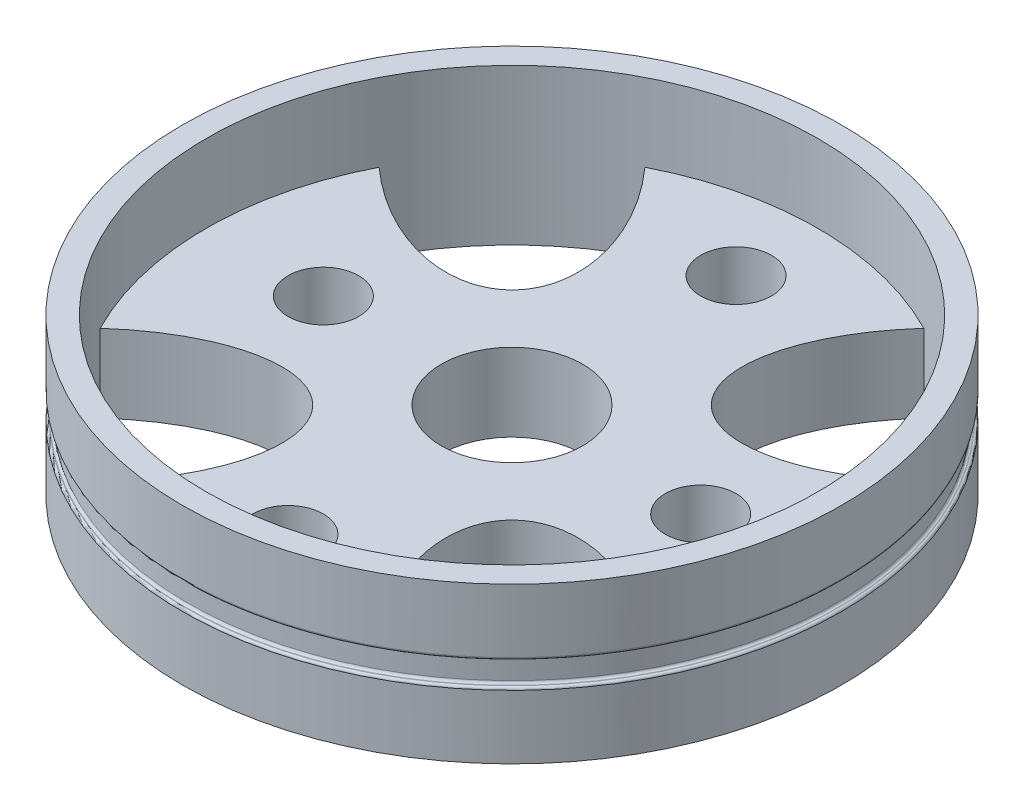
ISO-10303-21;
HEADER;
FILE_DESCRIPTION(('STEP AP214'),'2;1');
FILE_NAME('part.step','',(''),(''),'','','');
FILE_SCHEMA(('AUTOMOTIVE_DESIGN { 1 0 10303 214 1 1 1 1 }'));
ENDSEC;
DATA;
#1=APPLICATION_CONTEXT('core data for automotive mechanical design processes');
#2=APPLICATION_PROTOCOL_DEFINITION('international standard','automotive_design',2000,#1);
#3=PRODUCT_CONTEXT('',#1,'mechanical');
#4=PRODUCT('Part','Part','',(#3));
#5=PRODUCT_RELATED_PRODUCT_CATEGORY('part','',(#4));
#6=PRODUCT_DEFINITION_FORMATION('','',#4);
#7=PRODUCT_DEFINITION_CONTEXT('part definition',#1,'design');
#8=PRODUCT_DEFINITION('design','',#6,#7);
#9=PRODUCT_DEFINITION_SHAPE('','',#8);
#10=(LENGTH_UNIT() NAMED_UNIT(*) SI_UNIT(.MILLI.,.METRE.));
#11=(NAMED_UNIT(*) PLANE_ANGLE_UNIT() SI_UNIT($,.RADIAN.));
#12=(NAMED_UNIT(*) SI_UNIT($,.STERADIAN.) SOLID_ANGLE_UNIT());
#13=UNCERTAINTY_MEASURE_WITH_UNIT(LENGTH_MEASURE(1.E-05),#10,'distance_accuracy_value','');
#14=(GEOMETRIC_REPRESENTATION_CONTEXT(3) GLOBAL_UNCERTAINTY_ASSIGNED_CONTEXT((#13)) GLOBAL_UNIT_ASSIGNED_CONTEXT((#10,
#11,#12)) REPRESENTATION_CONTEXT('',''));
#15=CARTESIAN_POINT('',(0.,0.,0.));
#16=DIRECTION('',(0.,0.,1.));
#17=DIRECTION('',(1.,0.,0.));
#18=AXIS2_PLACEMENT_3D('',#15,#16,#17);
#19=CARTESIAN_POINT('',(0.,3.3,0.));
#20=DIRECTION('',(0.,1.,0.));
#21=DIRECTION('',(0.,0.,1.));
#22=AXIS2_PLACEMENT_3D('',#19,#20,#21);
#23=PLANE('',#22);
#24=CARTESIAN_POINT('',(-9.17471048589553,3.3,9.17471048589537));
#25=DIRECTION('',(0.,1.,0.));
#26=DIRECTION('',(-0.707106781186536,0.,0.707106781186559));
#27=AXIS2_PLACEMENT_3D('',#24,#25,#26);
#28=ELLIPSE('',#27,7.,4.00000000000012);
#29=CARTESIAN_POINT('',(-5.91445391265301,3.3,11.5485869228709));
#30=VERTEX_POINT('',#29);
#31=CARTESIAN_POINT('',(-11.5485869228712,3.3,5.91445391265352));
#32=VERTEX_POINT('',#31);
#33=EDGE_CURVE('E185',#30,#32,#28,.T.);
#34=ORIENTED_EDGE('',*,*,#33,.F.);
#35=CARTESIAN_POINT('',(0.,3.3,0.));
#36=DIRECTION('',(0.,1.,0.));
#37=DIRECTION('',(0.,0.,1.));
#38=AXIS2_PLACEMENT_3D('',#35,#36,#37);
#39=CIRCLE('',#38,12.975);
#40=CARTESIAN_POINT('',(5.91445391265348,3.3,11.5485869228714));
#41=VERTEX_POINT('',#40);
#42=EDGE_CURVE('E287',#30,#41,#39,.T.);
#43=ORIENTED_EDGE('',*,*,#42,.T.);
#44=CARTESIAN_POINT('',(9.1747104858954,3.3,9.1747104858955));
#45=DIRECTION('',(0.,1.,0.));
#46=DIRECTION('',(0.707106781186554,0.,0.707106781186541));
#47=AXIS2_PLACEMENT_3D('',#44,#45,#46);
#48=ELLIPSE('',#47,7.,4.00000000000006);
#49=CARTESIAN_POINT('',(11.5485869228708,3.3,5.914453912653));
#50=VERTEX_POINT('',#49);
#51=EDGE_CURVE('E149',#50,#41,#48,.T.);
#52=ORIENTED_EDGE('',*,*,#51,.F.);
#53=CARTESIAN_POINT('',(11.5485869228713,3.3,-5.91445391265322));
#54=VERTEX_POINT('',#53);
#55=EDGE_CURVE('E281',#50,#54,#39,.T.);
#56=ORIENTED_EDGE('',*,*,#55,.T.);
#57=CARTESIAN_POINT('',(9.17471048589545,3.3,-9.17471048589545));
#58=DIRECTION('',(0.,1.,0.));
#59=DIRECTION('',(0.707106781186548,0.,-0.707106781186548));
#60=AXIS2_PLACEMENT_3D('',#57,#58,#59);
#61=ELLIPSE('',#60,7.,4.);
#62=CARTESIAN_POINT('',(5.914453912653,3.3,-11.5485869228709));
#63=VERTEX_POINT('',#62);
#64=EDGE_CURVE('E110',#63,#54,#61,.T.);
#65=ORIENTED_EDGE('',*,*,#64,.F.);
#66=CARTESIAN_POINT('',(-5.91445391265325,3.3,-11.5485869228711));
#67=VERTEX_POINT('',#66);
#68=EDGE_CURVE('E481',#63,#67,#39,.T.);
#69=ORIENTED_EDGE('',*,*,#68,.T.);
#70=CARTESIAN_POINT('',(-9.17471048589534,3.3,-9.17471048589557));
#71=DIRECTION('',(0.,1.,0.));
#72=DIRECTION('',(-0.707106781186564,0.,-0.707106781186531));
#73=AXIS2_PLACEMENT_3D('',#70,#71,#72);
#74=ELLIPSE('',#73,7.,4.00000000000016);
#75=CARTESIAN_POINT('',(-11.5485869228708,3.3,-5.91445391265301));
#76=VERTEX_POINT('',#75);
#77=EDGE_CURVE('E124',#76,#67,#74,.T.);
#78=ORIENTED_EDGE('',*,*,#77,.F.);
#79=EDGE_CURVE('E118',#76,#32,#39,.T.);
#80=ORIENTED_EDGE('',*,*,#79,.T.);
#81=EDGE_LOOP('',(#34,#43,#52,#56,#65,#69,#78,#80));
#82=FACE_BOUND('',#81,.T.);
#83=CARTESIAN_POINT('',(0.,3.3,0.));
#84=DIRECTION('',(0.,1.,0.));
#85=DIRECTION('',(0.,0.,1.));
#86=AXIS2_PLACEMENT_3D('',#83,#84,#85);
#87=CIRCLE('',#86,3.);
#88=CARTESIAN_POINT('',(0.,3.3,3.));
#89=VERTEX_POINT('',#88);
#90=EDGE_CURVE('E162',#89,#89,#87,.T.);
#91=ORIENTED_EDGE('',*,*,#90,.F.);
#92=EDGE_LOOP('',(#91));
#93=FACE_BOUND('',#92,.T.);
#94=CARTESIAN_POINT('',(0.,3.3,9.5));
#95=DIRECTION('',(0.,-1.,0.));
#96=DIRECTION('',(0.,0.,-1.));
#97=AXIS2_PLACEMENT_3D('',#94,#95,#96);
#98=CIRCLE('',#97,1.5);
#99=CARTESIAN_POINT('',(0.,3.3,8.));
#100=VERTEX_POINT('',#99);
#101=EDGE_CURVE('E179',#100,#100,#98,.T.);
#102=ORIENTED_EDGE('',*,*,#101,.T.);
#103=EDGE_LOOP('',(#102));
#104=FACE_BOUND('',#103,.T.);
#105=CARTESIAN_POINT('',(0.,3.3,-9.5));
#106=DIRECTION('',(0.,1.,0.));
#107=DIRECTION('',(0.,0.,1.));
#108=AXIS2_PLACEMENT_3D('',#105,#106,#107);
#109=CIRCLE('',#108,1.5);
#110=CARTESIAN_POINT('',(0.,3.3,-8.));
#111=VERTEX_POINT('',#110);
#112=EDGE_CURVE('E175',#111,#111,#109,.T.);
#113=ORIENTED_EDGE('',*,*,#112,.F.);
#114=EDGE_LOOP('',(#113));
#115=FACE_BOUND('',#114,.T.);
#116=CARTESIAN_POINT('',(8.,3.3,0.));
#117=DIRECTION('',(0.,1.,0.));
#118=DIRECTION('',(0.,0.,1.));
#119=AXIS2_PLACEMENT_3D('',#116,#117,#118);
#120=CIRCLE('',#119,1.5);
#121=CARTESIAN_POINT('',(8.,3.3,1.5));
#122=VERTEX_POINT('',#121);
#123=EDGE_CURVE('E172',#122,#122,#120,.T.);
#124=ORIENTED_EDGE('',*,*,#123,.F.);
#125=EDGE_LOOP('',(#124));
#126=FACE_BOUND('',#125,.T.);
#127=CARTESIAN_POINT('',(-8.,3.3,0.));
#128=DIRECTION('',(0.,-1.,0.));
#129=DIRECTION('',(0.,0.,-1.));
#130=AXIS2_PLACEMENT_3D('',#127,#128,#129);
#131=CIRCLE('',#130,1.5);
#132=CARTESIAN_POINT('',(-8.,3.3,-1.5));
#133=VERTEX_POINT('',#132);
#134=EDGE_CURVE('E171',#133,#133,#131,.T.);
#135=ORIENTED_EDGE('',*,*,#134,.T.);
#136=EDGE_LOOP('',(#135));
#137=FACE_BOUND('',#136,.T.);
#138=ADVANCED_FACE('F38',(#82,#93,#104,#115,#126,#137),#23,.T.);
#139=CARTESIAN_POINT('',(0.,0.,0.));
#140=DIRECTION('',(0.,1.,0.));
#141=DIRECTION('',(0.,0.,1.));
#142=AXIS2_PLACEMENT_3D('',#139,#140,#141);
#143=PLANE('',#142);
#144=CARTESIAN_POINT('',(8.,0.,0.));
#145=DIRECTION('',(0.,1.,0.));
#146=DIRECTION('',(0.,0.,1.));
#147=AXIS2_PLACEMENT_3D('',#144,#145,#146);
#148=CIRCLE('',#147,1.5);
#149=CARTESIAN_POINT('',(8.,0.,1.5));
#150=VERTEX_POINT('',#149);
#151=EDGE_CURVE('E176',#150,#150,#148,.F.);
#152=ORIENTED_EDGE('',*,*,#151,.F.);
#153=EDGE_LOOP('',(#152));
#154=FACE_BOUND('',#153,.T.);
#155=CARTESIAN_POINT('',(0.,0.,0.));
#156=DIRECTION('',(0.,1.,0.));
#157=DIRECTION('',(0.,0.,1.));
#158=AXIS2_PLACEMENT_3D('',#155,#156,#157);
#159=CIRCLE('',#158,12.9750000000004);
#160=CARTESIAN_POINT('',(-5.914453912653,0.,-11.5485869228713));
#161=VERTEX_POINT('',#160);
#162=CARTESIAN_POINT('',(-11.5485869228711,0.,-5.91445391265322));
#163=VERTEX_POINT('',#162);
#164=EDGE_CURVE('E109',#161,#163,#159,.T.);
#165=ORIENTED_EDGE('',*,*,#164,.T.);
#166=CARTESIAN_POINT('',(-9.17471048589534,0.,-9.17471048589557));
#167=DIRECTION('',(0.,1.,0.));
#168=DIRECTION('',(-0.707106781186564,0.,-0.707106781186531));
#169=AXIS2_PLACEMENT_3D('',#166,#167,#168);
#170=ELLIPSE('',#169,7.,4.00000000000016);
#171=EDGE_CURVE('E103',#161,#163,#170,.F.);
#172=ORIENTED_EDGE('',*,*,#171,.F.);
#173=EDGE_LOOP('',(#165,#172));
#174=FACE_BOUND('',#173,.T.);
#175=CARTESIAN_POINT('',(0.,0.,0.));
#176=DIRECTION('',(0.,1.,0.));
#177=DIRECTION('',(0.,0.,1.));
#178=AXIS2_PLACEMENT_3D('',#175,#176,#177);
#179=CIRCLE('',#178,12.9750000000007);
#180=CARTESIAN_POINT('',(5.91445391265336,0.,11.5485869228715));
#181=VERTEX_POINT('',#180);
#182=CARTESIAN_POINT('',(11.5485869228714,0.,5.91445391265346));
#183=VERTEX_POINT('',#182);
#184=EDGE_CURVE('E150',#181,#183,#179,.T.);
#185=ORIENTED_EDGE('',*,*,#184,.T.);
#186=CARTESIAN_POINT('',(9.1747104858954,0.,9.1747104858955));
#187=DIRECTION('',(0.,1.,0.));
#188=DIRECTION('',(0.707106781186554,0.,0.707106781186541));
#189=AXIS2_PLACEMENT_3D('',#186,#187,#188);
#190=ELLIPSE('',#189,7.,4.00000000000006);
#191=EDGE_CURVE('E154',#181,#183,#190,.F.);
#192=ORIENTED_EDGE('',*,*,#191,.F.);
#193=EDGE_LOOP('',(#185,#192));
#194=FACE_BOUND('',#193,.T.);
#195=CARTESIAN_POINT('',(0.,0.,0.));
#196=DIRECTION('',(0.,1.,0.));
#197=DIRECTION('',(0.,0.,1.));
#198=AXIS2_PLACEMENT_3D('',#195,#196,#197);
#199=CIRCLE('',#198,3.);
#200=CARTESIAN_POINT('',(0.,0.,3.));
#201=VERTEX_POINT('',#200);
#202=EDGE_CURVE('E163',#201,#201,#199,.F.);
#203=ORIENTED_EDGE('',*,*,#202,.F.);
#204=EDGE_LOOP('',(#203));
#205=FACE_BOUND('',#204,.T.);
#206=CARTESIAN_POINT('',(0.,0.,-9.5));
#207=DIRECTION('',(0.,1.,0.));
#208=DIRECTION('',(0.,0.,1.));
#209=AXIS2_PLACEMENT_3D('',#206,#207,#208);
#210=CIRCLE('',#209,1.5);
#211=CARTESIAN_POINT('',(0.,0.,-8.));
#212=VERTEX_POINT('',#211);
#213=EDGE_CURVE('E288',#212,#212,#210,.F.);
#214=ORIENTED_EDGE('',*,*,#213,.F.);
#215=EDGE_LOOP('',(#214));
#216=FACE_BOUND('',#215,.T.);
#217=CARTESIAN_POINT('',(0.,0.,0.));
#218=DIRECTION('',(0.,1.,0.));
#219=DIRECTION('',(0.,0.,1.));
#220=AXIS2_PLACEMENT_3D('',#217,#218,#219);
#221=CIRCLE('',#220,13.975);
#222=CARTESIAN_POINT('',(0.,0.,13.975));
#223=VERTEX_POINT('',#222);
#224=EDGE_CURVE('E278',#223,#223,#221,.T.);
#225=ORIENTED_EDGE('',*,*,#224,.F.);
#226=EDGE_LOOP('',(#225));
#227=FACE_BOUND('',#226,.T.);
#228=CARTESIAN_POINT('',(0.,0.,0.));
#229=DIRECTION('',(0.,1.,0.));
#230=DIRECTION('',(0.,0.,1.));
#231=AXIS2_PLACEMENT_3D('',#228,#229,#230);
#232=CIRCLE('',#231,12.9750000000005);
#233=CARTESIAN_POINT('',(11.5485869228712,0.,-5.91445391265333));
#234=VERTEX_POINT('',#233);
#235=CARTESIAN_POINT('',(5.91445391265348,0.,-11.5485869228712));
#236=VERTEX_POINT('',#235);
#237=EDGE_CURVE('E148',#234,#236,#232,.T.);
#238=ORIENTED_EDGE('',*,*,#237,.T.);
#239=CARTESIAN_POINT('',(9.17471048589545,0.,-9.17471048589545));
#240=DIRECTION('',(0.,1.,0.));
#241=DIRECTION('',(0.707106781186548,0.,-0.707106781186548));
#242=AXIS2_PLACEMENT_3D('',#239,#240,#241);
#243=ELLIPSE('',#242,7.,4.);
#244=EDGE_CURVE('E146',#234,#236,#243,.F.);
#245=ORIENTED_EDGE('',*,*,#244,.F.);
#246=EDGE_LOOP('',(#238,#245));
#247=FACE_BOUND('',#246,.T.);
#248=CARTESIAN_POINT('',(0.,0.,0.));
#249=DIRECTION('',(0.,1.,0.));
#250=DIRECTION('',(0.,0.,1.));
#251=AXIS2_PLACEMENT_3D('',#248,#249,#250);
#252=CIRCLE('',#251,12.9750000000005);
#253=CARTESIAN_POINT('',(-11.5485869228714,0.,5.91445391265321));
#254=VERTEX_POINT('',#253);
#255=CARTESIAN_POINT('',(-5.9144539126532,0.,11.5485869228713));
#256=VERTEX_POINT('',#255);
#257=EDGE_CURVE('E188',#254,#256,#252,.T.);
#258=ORIENTED_EDGE('',*,*,#257,.T.);
#259=CARTESIAN_POINT('',(-9.17471048589553,0.,9.17471048589537));
#260=DIRECTION('',(0.,1.,0.));
#261=DIRECTION('',(-0.707106781186536,0.,0.707106781186559));
#262=AXIS2_PLACEMENT_3D('',#259,#260,#261);
#263=ELLIPSE('',#262,7.,4.00000000000012);
#264=EDGE_CURVE('E127',#254,#256,#263,.F.);
#265=ORIENTED_EDGE('',*,*,#264,.F.);
#266=EDGE_LOOP('',(#258,#265));
#267=FACE_BOUND('',#266,.T.);
#268=CARTESIAN_POINT('',(0.,0.,9.5));
#269=DIRECTION('',(0.,1.,0.));
#270=DIRECTION('',(0.,0.,1.));
#271=AXIS2_PLACEMENT_3D('',#268,#269,#270);
#272=CIRCLE('',#271,1.5);
#273=CARTESIAN_POINT('',(0.,0.,11.));
#274=VERTEX_POINT('',#273);
#275=EDGE_CURVE('E182',#274,#274,#272,.T.);
#276=ORIENTED_EDGE('',*,*,#275,.T.);
#277=EDGE_LOOP('',(#276));
#278=FACE_BOUND('',#277,.T.);
#279=CARTESIAN_POINT('',(-8.,0.,0.));
#280=DIRECTION('',(0.,1.,0.));
#281=DIRECTION('',(0.,0.,1.));
#282=AXIS2_PLACEMENT_3D('',#279,#280,#281);
#283=CIRCLE('',#282,1.5);
#284=CARTESIAN_POINT('',(-8.,0.,1.5));
#285=VERTEX_POINT('',#284);
#286=EDGE_CURVE('E168',#285,#285,#283,.T.);
#287=ORIENTED_EDGE('',*,*,#286,.T.);
#288=EDGE_LOOP('',(#287));
#289=FACE_BOUND('',#288,.T.);
#290=ADVANCED_FACE('F120',(#154,#174,#194,#205,#216,#227,#247,#267,#278,#289),#143,.F.);
#291=CARTESIAN_POINT('',(0.,6.6,0.));
#292=DIRECTION('',(0.,-1.,0.));
#293=DIRECTION('',(0.,0.,-1.));
#294=AXIS2_PLACEMENT_3D('',#291,#292,#293);
#295=CYLINDRICAL_SURFACE('',#294,13.975);
#296=CARTESIAN_POINT('',(0.,3.9,0.));
#297=DIRECTION('',(0.,1.,0.));
#298=DIRECTION('',(-1.,0.,0.));
#299=AXIS2_PLACEMENT_3D('',#296,#297,#298);
#300=CIRCLE('',#299,13.975);
#301=CARTESIAN_POINT('',(-13.975,3.9,0.));
#302=VERTEX_POINT('',#301);
#303=EDGE_CURVE('E274',#302,#302,#300,.T.);
#304=ORIENTED_EDGE('',*,*,#303,.T.);
#305=EDGE_LOOP('',(#304));
#306=FACE_BOUND('',#305,.T.);
#307=CARTESIAN_POINT('',(0.,6.6,0.));
#308=DIRECTION('',(0.,1.,0.));
#309=DIRECTION('',(0.,0.,1.));
#310=AXIS2_PLACEMENT_3D('',#307,#308,#309);
#311=CIRCLE('',#310,13.975);
#312=CARTESIAN_POINT('',(0.,6.6,13.975));
#313=VERTEX_POINT('',#312);
#314=EDGE_CURVE('E277',#313,#313,#311,.T.);
#315=ORIENTED_EDGE('',*,*,#314,.F.);
#316=EDGE_LOOP('',(#315));
#317=FACE_BOUND('',#316,.T.);
#318=ADVANCED_FACE('F230',(#306,#317),#295,.T.);
#319=CARTESIAN_POINT('',(0.,6.6,0.));
#320=DIRECTION('',(0.,1.,0.));
#321=DIRECTION('',(0.,0.,1.));
#322=AXIS2_PLACEMENT_3D('',#319,#320,#321);
#323=PLANE('',#322);
#324=CARTESIAN_POINT('',(0.,6.6,0.));
#325=DIRECTION('',(0.,1.,0.));
#326=DIRECTION('',(0.,0.,1.));
#327=AXIS2_PLACEMENT_3D('',#324,#325,#326);
#328=CIRCLE('',#327,12.975);
#329=CARTESIAN_POINT('',(0.,6.6,12.975));
#330=VERTEX_POINT('',#329);
#331=EDGE_CURVE('E284',#330,#330,#328,.T.);
#332=ORIENTED_EDGE('',*,*,#331,.F.);
#333=EDGE_LOOP('',(#332));
#334=FACE_BOUND('',#333,.T.);
#335=ORIENTED_EDGE('',*,*,#314,.T.);
#336=EDGE_LOOP('',(#335));
#337=FACE_BOUND('',#336,.T.);
#338=ADVANCED_FACE('F227',(#334,#337),#323,.T.);
#339=CARTESIAN_POINT('',(0.,3.3,0.));
#340=DIRECTION('',(0.,1.,0.));
#341=DIRECTION('',(0.,0.,1.));
#342=AXIS2_PLACEMENT_3D('',#339,#340,#341);
#343=CYLINDRICAL_SURFACE('',#342,12.975);
#344=ORIENTED_EDGE('',*,*,#55,.F.);
#345=DIRECTION('',(0.,1.,0.));
#346=VECTOR('',#345,1.);
#347=CARTESIAN_POINT('',(11.5485869228714,-11.4194260008678,5.91445391265346));
#348=LINE('',#347,#346);
#349=EDGE_CURVE('E153',#183,#50,#348,.T.);
#350=ORIENTED_EDGE('',*,*,#349,.F.);
#351=ORIENTED_EDGE('',*,*,#184,.F.);
#352=DIRECTION('',(0.,1.,0.));
#353=VECTOR('',#352,1.);
#354=CARTESIAN_POINT('',(5.91445391265348,-11.4194260008678,11.5485869228714));
#355=LINE('',#354,#353);
#356=EDGE_CURVE('E155',#181,#41,#355,.T.);
#357=ORIENTED_EDGE('',*,*,#356,.T.);
#358=ORIENTED_EDGE('',*,*,#42,.F.);
#359=DIRECTION('',(0.,1.,0.));
#360=VECTOR('',#359,1.);
#361=CARTESIAN_POINT('',(-5.9144539126532,-11.4194260008678,11.5485869228713));
#362=LINE('',#361,#360);
#363=EDGE_CURVE('E53',#256,#30,#362,.T.);
#364=ORIENTED_EDGE('',*,*,#363,.F.);
#365=ORIENTED_EDGE('',*,*,#257,.F.);
#366=DIRECTION('',(0.,1.,0.));
#367=VECTOR('',#366,1.);
#368=CARTESIAN_POINT('',(-11.5485869228712,-11.4194260008678,5.91445391265352));
#369=LINE('',#368,#367);
#370=EDGE_CURVE('E191',#254,#32,#369,.T.);
#371=ORIENTED_EDGE('',*,*,#370,.T.);
#372=ORIENTED_EDGE('',*,*,#79,.F.);
#373=DIRECTION('',(0.,1.,0.));
#374=VECTOR('',#373,1.);
#375=CARTESIAN_POINT('',(-11.5485869228711,-11.4194260008678,-5.91445391265322));
#376=LINE('',#375,#374);
#377=EDGE_CURVE('E61',#163,#76,#376,.T.);
#378=ORIENTED_EDGE('',*,*,#377,.F.);
#379=ORIENTED_EDGE('',*,*,#164,.F.);
#380=DIRECTION('',(0.,1.,0.));
#381=VECTOR('',#380,1.);
#382=CARTESIAN_POINT('',(-5.91445391265325,-11.4194260008678,-11.5485869228711));
#383=LINE('',#382,#381);
#384=EDGE_CURVE('E105',#161,#67,#383,.T.);
#385=ORIENTED_EDGE('',*,*,#384,.T.);
#386=ORIENTED_EDGE('',*,*,#68,.F.);
#387=DIRECTION('',(0.,1.,0.));
#388=VECTOR('',#387,1.);
#389=CARTESIAN_POINT('',(5.91445391265348,-11.4194260008678,-11.5485869228712));
#390=LINE('',#389,#388);
#391=EDGE_CURVE('E488',#236,#63,#390,.T.);
#392=ORIENTED_EDGE('',*,*,#391,.F.);
#393=ORIENTED_EDGE('',*,*,#237,.F.);
#394=DIRECTION('',(0.,1.,0.));
#395=VECTOR('',#394,1.);
#396=CARTESIAN_POINT('',(11.5485869228713,-11.4194260008678,-5.91445391265322));
#397=LINE('',#396,#395);
#398=EDGE_CURVE('E486',#234,#54,#397,.T.);
#399=ORIENTED_EDGE('',*,*,#398,.T.);
#400=EDGE_LOOP('',(#344,#350,#351,#357,#358,#364,#365,#371,#372,#378,#379,#385,#386,#392,#393,#399));
#401=FACE_BOUND('',#400,.T.);
#402=ORIENTED_EDGE('',*,*,#331,.T.);
#403=EDGE_LOOP('',(#402));
#404=FACE_BOUND('',#403,.T.);
#405=ADVANCED_FACE('F115',(#401,#404),#343,.F.);
#406=CARTESIAN_POINT('',(0.,3.8,0.));
#407=DIRECTION('',(0.,1.,0.));
#408=DIRECTION('',(-1.,0.,0.));
#409=AXIS2_PLACEMENT_3D('',#406,#407,#408);
#410=PLANE('',#409);
#411=CARTESIAN_POINT('',(0.,3.8,0.));
#412=DIRECTION('',(0.,1.,0.));
#413=DIRECTION('',(-1.,0.,0.));
#414=AXIS2_PLACEMENT_3D('',#411,#412,#413);
#415=CIRCLE('',#414,13.875);
#416=CARTESIAN_POINT('',(-13.875,3.8,0.));
#417=VERTEX_POINT('',#416);
#418=EDGE_CURVE('E268',#417,#417,#415,.F.);
#419=ORIENTED_EDGE('',*,*,#418,.T.);
#420=EDGE_LOOP('',(#419));
#421=FACE_BOUND('',#420,.T.);
#422=CARTESIAN_POINT('',(0.,3.8,0.));
#423=DIRECTION('',(0.,1.,0.));
#424=DIRECTION('',(-1.,0.,0.));
#425=AXIS2_PLACEMENT_3D('',#422,#423,#424);
#426=CIRCLE('',#425,13.85);
#427=CARTESIAN_POINT('',(-13.85,3.8,0.));
#428=VERTEX_POINT('',#427);
#429=EDGE_CURVE('E271',#428,#428,#426,.T.);
#430=ORIENTED_EDGE('',*,*,#429,.T.);
#431=EDGE_LOOP('',(#430));
#432=FACE_BOUND('',#431,.T.);
#433=ADVANCED_FACE('F217',(#421,#432),#410,.F.);
#434=CARTESIAN_POINT('',(0.,3.8,0.));
#435=DIRECTION('',(0.,-1.,0.));
#436=DIRECTION('',(1.,0.,0.));
#437=AXIS2_PLACEMENT_3D('',#434,#435,#436);
#438=CYLINDRICAL_SURFACE('',#437,13.75);
#439=CARTESIAN_POINT('',(0.,2.9,0.));
#440=DIRECTION('',(0.,1.,0.));
#441=DIRECTION('',(-1.,0.,0.));
#442=AXIS2_PLACEMENT_3D('',#439,#440,#441);
#443=CIRCLE('',#442,13.75);
#444=CARTESIAN_POINT('',(-13.75,2.9,0.));
#445=VERTEX_POINT('',#444);
#446=EDGE_CURVE('E11',#445,#445,#443,.T.);
#447=ORIENTED_EDGE('',*,*,#446,.T.);
#448=EDGE_LOOP('',(#447));
#449=FACE_BOUND('',#448,.T.);
#450=CARTESIAN_POINT('',(0.,3.7,0.));
#451=DIRECTION('',(0.,1.,0.));
#452=DIRECTION('',(-1.,0.,0.));
#453=AXIS2_PLACEMENT_3D('',#450,#451,#452);
#454=CIRCLE('',#453,13.75);
#455=CARTESIAN_POINT('',(-13.75,3.7,0.));
#456=VERTEX_POINT('',#455);
#457=EDGE_CURVE('E46',#456,#456,#454,.F.);
#458=ORIENTED_EDGE('',*,*,#457,.T.);
#459=EDGE_LOOP('',(#458));
#460=FACE_BOUND('',#459,.T.);
#461=ADVANCED_FACE('F213',(#449,#460),#438,.T.);
#462=CARTESIAN_POINT('',(0.,2.8,0.));
#463=DIRECTION('',(0.,1.,0.));
#464=DIRECTION('',(-1.,0.,0.));
#465=AXIS2_PLACEMENT_3D('',#462,#463,#464);
#466=PLANE('',#465);
#467=CARTESIAN_POINT('',(0.,2.8,0.));
#468=DIRECTION('',(0.,1.,0.));
#469=DIRECTION('',(-1.,0.,0.));
#470=AXIS2_PLACEMENT_3D('',#467,#468,#469);
#471=CIRCLE('',#470,13.875);
#472=CARTESIAN_POINT('',(-13.875,2.8,0.));
#473=VERTEX_POINT('',#472);
#474=EDGE_CURVE('E262',#473,#473,#471,.T.);
#475=ORIENTED_EDGE('',*,*,#474,.T.);
#476=EDGE_LOOP('',(#475));
#477=FACE_BOUND('',#476,.T.);
#478=CARTESIAN_POINT('',(0.,2.8,0.));
#479=DIRECTION('',(0.,1.,0.));
#480=DIRECTION('',(-1.,0.,0.));
#481=AXIS2_PLACEMENT_3D('',#478,#479,#480);
#482=CIRCLE('',#481,13.85);
#483=CARTESIAN_POINT('',(-13.85,2.8,0.));
#484=VERTEX_POINT('',#483);
#485=EDGE_CURVE('E255',#484,#484,#482,.F.);
#486=ORIENTED_EDGE('',*,*,#485,.T.);
#487=EDGE_LOOP('',(#486));
#488=FACE_BOUND('',#487,.T.);
#489=ADVANCED_FACE('F209',(#477,#488),#466,.T.);
#490=CARTESIAN_POINT('',(0.,2.7,0.));
#491=DIRECTION('',(0.,1.,0.));
#492=DIRECTION('',(-1.,0.,0.));
#493=AXIS2_PLACEMENT_3D('',#490,#491,#492);
#494=CIRCLE('',#493,13.975);
#495=CARTESIAN_POINT('',(-13.975,2.7,0.));
#496=VERTEX_POINT('',#495);
#497=EDGE_CURVE('E260',#496,#496,#494,.F.);
#498=ORIENTED_EDGE('',*,*,#497,.T.);
#499=EDGE_LOOP('',(#498));
#500=FACE_BOUND('',#499,.T.);
#501=ORIENTED_EDGE('',*,*,#224,.T.);
#502=EDGE_LOOP('',(#501));
#503=FACE_BOUND('',#502,.T.);
#504=ADVANCED_FACE('F212',(#500,#503),#295,.T.);
#505=CARTESIAN_POINT('',(0.,3.9,0.));
#506=DIRECTION('',(0.,1.,0.));
#507=DIRECTION('',(-1.,0.,0.));
#508=AXIS2_PLACEMENT_3D('',#505,#506,#507);
#509=TOROIDAL_SURFACE('',#508,13.875,0.1);
#510=ORIENTED_EDGE('',*,*,#418,.F.);
#511=EDGE_LOOP('',(#510));
#512=FACE_BOUND('',#511,.T.);
#513=ORIENTED_EDGE('',*,*,#303,.F.);
#514=EDGE_LOOP('',(#513));
#515=FACE_BOUND('',#514,.T.);
#516=ADVANCED_FACE('F238',(#512,#515),#509,.T.);
#517=CARTESIAN_POINT('',(0.,2.7,0.));
#518=DIRECTION('',(0.,1.,0.));
#519=DIRECTION('',(-1.,0.,0.));
#520=AXIS2_PLACEMENT_3D('',#517,#518,#519);
#521=TOROIDAL_SURFACE('',#520,13.875,0.1);
#522=ORIENTED_EDGE('',*,*,#497,.F.);
#523=EDGE_LOOP('',(#522));
#524=FACE_BOUND('',#523,.T.);
#525=ORIENTED_EDGE('',*,*,#474,.F.);
#526=EDGE_LOOP('',(#525));
#527=FACE_BOUND('',#526,.T.);
#528=ADVANCED_FACE('F241',(#524,#527),#521,.T.);
#529=CARTESIAN_POINT('',(0.,2.9,0.));
#530=DIRECTION('',(0.,1.,0.));
#531=DIRECTION('',(-1.,0.,0.));
#532=AXIS2_PLACEMENT_3D('',#529,#530,#531);
#533=TOROIDAL_SURFACE('',#532,13.85,0.1);
#534=ORIENTED_EDGE('',*,*,#485,.F.);
#535=EDGE_LOOP('',(#534));
#536=FACE_BOUND('',#535,.T.);
#537=ORIENTED_EDGE('',*,*,#446,.F.);
#538=EDGE_LOOP('',(#537));
#539=FACE_BOUND('',#538,.T.);
#540=ADVANCED_FACE('F244',(#536,#539),#533,.F.);
#541=CARTESIAN_POINT('',(0.,3.7,0.));
#542=DIRECTION('',(0.,1.,0.));
#543=DIRECTION('',(-1.,0.,0.));
#544=AXIS2_PLACEMENT_3D('',#541,#542,#543);
#545=TOROIDAL_SURFACE('',#544,13.85,0.1);
#546=ORIENTED_EDGE('',*,*,#457,.F.);
#547=EDGE_LOOP('',(#546));
#548=FACE_BOUND('',#547,.T.);
#549=ORIENTED_EDGE('',*,*,#429,.F.);
#550=EDGE_LOOP('',(#549));
#551=FACE_BOUND('',#550,.T.);
#552=ADVANCED_FACE('F40',(#548,#551),#545,.F.);
#553=CARTESIAN_POINT('',(0.,-11.4194260008678,-9.5));
#554=DIRECTION('',(0.,1.,0.));
#555=DIRECTION('',(0.,0.,1.));
#556=AXIS2_PLACEMENT_3D('',#553,#554,#555);
#557=CYLINDRICAL_SURFACE('',#556,1.5);
#558=ORIENTED_EDGE('',*,*,#213,.T.);
#559=EDGE_LOOP('',(#558));
#560=FACE_BOUND('',#559,.T.);
#561=ORIENTED_EDGE('',*,*,#112,.T.);
#562=EDGE_LOOP('',(#561));
#563=FACE_BOUND('',#562,.T.);
#564=ADVANCED_FACE('F204',(#560,#563),#557,.F.);
#565=CARTESIAN_POINT('',(0.,-11.4194260008678,0.));
#566=DIRECTION('',(0.,1.,0.));
#567=DIRECTION('',(0.,0.,1.));
#568=AXIS2_PLACEMENT_3D('',#565,#566,#567);
#569=CYLINDRICAL_SURFACE('',#568,3.);
#570=ORIENTED_EDGE('',*,*,#202,.T.);
#571=EDGE_LOOP('',(#570));
#572=FACE_BOUND('',#571,.T.);
#573=ORIENTED_EDGE('',*,*,#90,.T.);
#574=EDGE_LOOP('',(#573));
#575=FACE_BOUND('',#574,.T.);
#576=ADVANCED_FACE('F207',(#572,#575),#569,.F.);
#577=CARTESIAN_POINT('',(9.1747104858954,-11.4194260008678,9.1747104858955));
#578=DIRECTION('',(0.,1.,0.));
#579=DIRECTION('',(0.707106781186554,0.,0.707106781186541));
#580=AXIS2_PLACEMENT_3D('',#577,#578,#579);
#581=ELLIPSE('',#580,7.,4.00000000000006);
#582=DIRECTION('',(0.,1.,0.));
#583=VECTOR('',#582,1.);
#584=SURFACE_OF_LINEAR_EXTRUSION('',#581,#583);
#585=ORIENTED_EDGE('',*,*,#191,.T.);
#586=ORIENTED_EDGE('',*,*,#349,.T.);
#587=ORIENTED_EDGE('',*,*,#51,.T.);
#588=ORIENTED_EDGE('',*,*,#356,.F.);
#589=EDGE_LOOP('',(#585,#586,#587,#588));
#590=FACE_BOUND('',#589,.T.);
#591=ADVANCED_FACE('F138',(#590),#584,.F.);
#592=CARTESIAN_POINT('',(9.17471048589545,-11.4194260008678,-9.17471048589545));
#593=DIRECTION('',(0.,1.,0.));
#594=DIRECTION('',(0.707106781186548,0.,-0.707106781186548));
#595=AXIS2_PLACEMENT_3D('',#592,#593,#594);
#596=ELLIPSE('',#595,7.,4.);
#597=DIRECTION('',(0.,1.,0.));
#598=VECTOR('',#597,1.);
#599=SURFACE_OF_LINEAR_EXTRUSION('',#596,#598);
#600=ORIENTED_EDGE('',*,*,#244,.T.);
#601=ORIENTED_EDGE('',*,*,#391,.T.);
#602=ORIENTED_EDGE('',*,*,#64,.T.);
#603=ORIENTED_EDGE('',*,*,#398,.F.);
#604=EDGE_LOOP('',(#600,#601,#602,#603));
#605=FACE_BOUND('',#604,.T.);
#606=ADVANCED_FACE('F134',(#605),#599,.F.);
#607=CARTESIAN_POINT('',(-9.17471048589534,-11.4194260008678,-9.17471048589557));
#608=DIRECTION('',(0.,1.,0.));
#609=DIRECTION('',(-0.707106781186564,0.,-0.707106781186531));
#610=AXIS2_PLACEMENT_3D('',#607,#608,#609);
#611=ELLIPSE('',#610,7.,4.00000000000016);
#612=DIRECTION('',(0.,1.,0.));
#613=VECTOR('',#612,1.);
#614=SURFACE_OF_LINEAR_EXTRUSION('',#611,#613);
#615=ORIENTED_EDGE('',*,*,#171,.T.);
#616=ORIENTED_EDGE('',*,*,#377,.T.);
#617=ORIENTED_EDGE('',*,*,#77,.T.);
#618=ORIENTED_EDGE('',*,*,#384,.F.);
#619=EDGE_LOOP('',(#615,#616,#617,#618));
#620=FACE_BOUND('',#619,.T.);
#621=ADVANCED_FACE('F104',(#620),#614,.F.);
#622=CARTESIAN_POINT('',(-9.17471048589553,-11.4194260008678,9.17471048589537));
#623=DIRECTION('',(0.,1.,0.));
#624=DIRECTION('',(-0.707106781186536,0.,0.707106781186559));
#625=AXIS2_PLACEMENT_3D('',#622,#623,#624);
#626=ELLIPSE('',#625,7.,4.00000000000012);
#627=DIRECTION('',(0.,1.,0.));
#628=VECTOR('',#627,1.);
#629=SURFACE_OF_LINEAR_EXTRUSION('',#626,#628);
#630=ORIENTED_EDGE('',*,*,#264,.T.);
#631=ORIENTED_EDGE('',*,*,#363,.T.);
#632=ORIENTED_EDGE('',*,*,#33,.T.);
#633=ORIENTED_EDGE('',*,*,#370,.F.);
#634=EDGE_LOOP('',(#630,#631,#632,#633));
#635=FACE_BOUND('',#634,.T.);
#636=ADVANCED_FACE('F133',(#635),#629,.F.);
#637=CARTESIAN_POINT('',(0.,-11.4194260008678,9.5));
#638=DIRECTION('',(0.,1.,0.));
#639=DIRECTION('',(0.,0.,1.));
#640=AXIS2_PLACEMENT_3D('',#637,#638,#639);
#641=CYLINDRICAL_SURFACE('',#640,1.5);
#642=ORIENTED_EDGE('',*,*,#275,.F.);
#643=EDGE_LOOP('',(#642));
#644=FACE_BOUND('',#643,.T.);
#645=ORIENTED_EDGE('',*,*,#101,.F.);
#646=EDGE_LOOP('',(#645));
#647=FACE_BOUND('',#646,.T.);
#648=ADVANCED_FACE('F202',(#644,#647),#641,.F.);
#649=CARTESIAN_POINT('',(8.,-11.4194260008678,0.));
#650=DIRECTION('',(0.,1.,0.));
#651=DIRECTION('',(0.,0.,1.));
#652=AXIS2_PLACEMENT_3D('',#649,#650,#651);
#653=CYLINDRICAL_SURFACE('',#652,1.5);
#654=ORIENTED_EDGE('',*,*,#151,.T.);
#655=EDGE_LOOP('',(#654));
#656=FACE_BOUND('',#655,.T.);
#657=ORIENTED_EDGE('',*,*,#123,.T.);
#658=EDGE_LOOP('',(#657));
#659=FACE_BOUND('',#658,.T.);
#660=ADVANCED_FACE('F303',(#656,#659),#653,.F.);
#661=CARTESIAN_POINT('',(-8.,-11.4194260008678,0.));
#662=DIRECTION('',(0.,1.,0.));
#663=DIRECTION('',(0.,0.,1.));
#664=AXIS2_PLACEMENT_3D('',#661,#662,#663);
#665=CYLINDRICAL_SURFACE('',#664,1.5);
#666=ORIENTED_EDGE('',*,*,#286,.F.);
#667=EDGE_LOOP('',(#666));
#668=FACE_BOUND('',#667,.T.);
#669=ORIENTED_EDGE('',*,*,#134,.F.);
#670=EDGE_LOOP('',(#669));
#671=FACE_BOUND('',#670,.T.);
#672=ADVANCED_FACE('F301',(#668,#671),#665,.F.);
#673=CLOSED_SHELL('',(#138,#290,#318,#338,#405,#433,#461,#489,#504,#516,#528,#540,#552,#564,
#576,#591,#606,#621,#636,#648,#660,#672));
#674=MANIFOLD_SOLID_BREP('B2',#673);
#675=ADVANCED_BREP_SHAPE_REPRESENTATION('',(#18,#674),#14);
#676=SHAPE_DEFINITION_REPRESENTATION(#9,#675);
ENDSEC;
END-ISO-10303-21;
